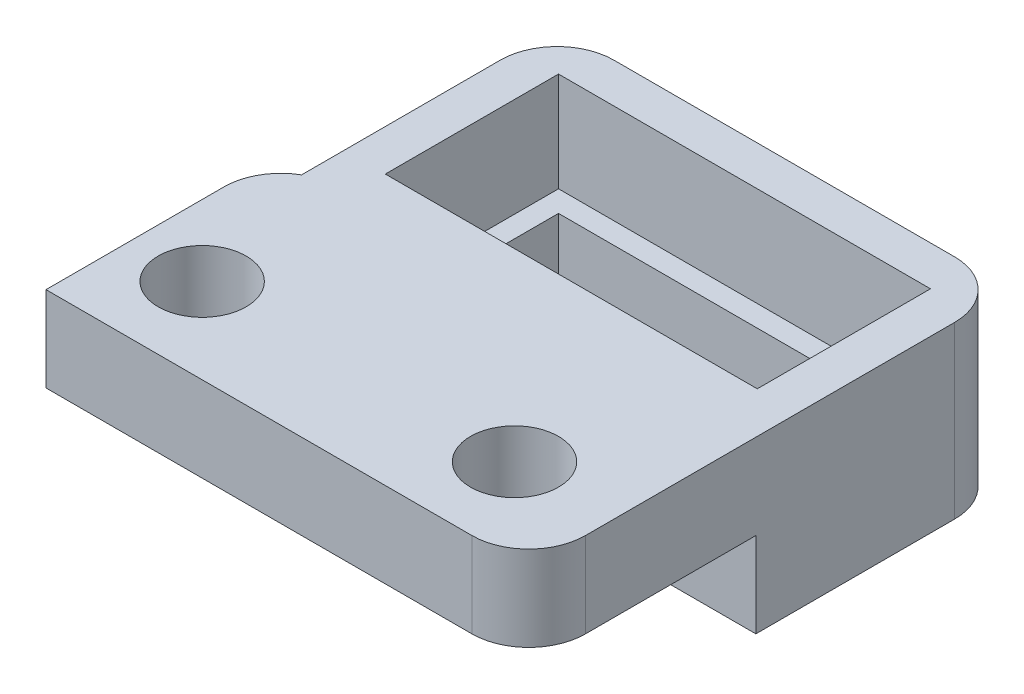
ISO-10303-21;
HEADER;
FILE_DESCRIPTION(('STEP AP214'),'2;1');
FILE_NAME('part.step','',(''),(''),'','','');
FILE_SCHEMA(('AUTOMOTIVE_DESIGN { 1 0 10303 214 1 1 1 1 }'));
ENDSEC;
DATA;
#1=APPLICATION_CONTEXT('core data for automotive mechanical design processes');
#2=APPLICATION_PROTOCOL_DEFINITION('international standard','automotive_design',2000,#1);
#3=PRODUCT_CONTEXT('',#1,'mechanical');
#4=PRODUCT('Part','Part','',(#3));
#5=PRODUCT_RELATED_PRODUCT_CATEGORY('part','',(#4));
#6=PRODUCT_DEFINITION_FORMATION('','',#4);
#7=PRODUCT_DEFINITION_CONTEXT('part definition',#1,'design');
#8=PRODUCT_DEFINITION('design','',#6,#7);
#9=PRODUCT_DEFINITION_SHAPE('','',#8);
#10=(LENGTH_UNIT() NAMED_UNIT(*) SI_UNIT(.MILLI.,.METRE.));
#11=(NAMED_UNIT(*) PLANE_ANGLE_UNIT() SI_UNIT($,.RADIAN.));
#12=(NAMED_UNIT(*) SI_UNIT($,.STERADIAN.) SOLID_ANGLE_UNIT());
#13=UNCERTAINTY_MEASURE_WITH_UNIT(LENGTH_MEASURE(1.E-05),#10,'distance_accuracy_value','');
#14=(GEOMETRIC_REPRESENTATION_CONTEXT(3) GLOBAL_UNCERTAINTY_ASSIGNED_CONTEXT((#13)) GLOBAL_UNIT_ASSIGNED_CONTEXT((#10,
#11,#12)) REPRESENTATION_CONTEXT('',''));
#15=CARTESIAN_POINT('',(0.,0.,0.));
#16=DIRECTION('',(0.,0.,1.));
#17=DIRECTION('',(1.,0.,0.));
#18=AXIS2_PLACEMENT_3D('',#15,#16,#17);
#19=CARTESIAN_POINT('',(0.,3.,0.));
#20=DIRECTION('',(0.,-1.,0.));
#21=DIRECTION('',(0.,0.,-1.));
#22=AXIS2_PLACEMENT_3D('',#19,#20,#21);
#23=PLANE('',#22);
#24=CARTESIAN_POINT('',(3.5,3.,-3.));
#25=DIRECTION('',(0.,1.,0.));
#26=DIRECTION('',(0.,0.,1.));
#27=AXIS2_PLACEMENT_3D('',#24,#25,#26);
#28=CIRCLE('',#27,1.55);
#29=CARTESIAN_POINT('',(3.5,3.,-1.45));
#30=VERTEX_POINT('',#29);
#31=EDGE_CURVE('E213',#30,#30,#28,.T.);
#32=ORIENTED_EDGE('',*,*,#31,.F.);
#33=EDGE_LOOP('',(#32));
#34=FACE_BOUND('',#33,.T.);
#35=CARTESIAN_POINT('',(14.5,3.,-3.));
#36=DIRECTION('',(0.,1.,0.));
#37=DIRECTION('',(0.,0.,1.));
#38=AXIS2_PLACEMENT_3D('',#35,#36,#37);
#39=CIRCLE('',#38,1.55);
#40=CARTESIAN_POINT('',(14.5,3.,-1.45));
#41=VERTEX_POINT('',#40);
#42=EDGE_CURVE('E219',#41,#41,#39,.T.);
#43=ORIENTED_EDGE('',*,*,#42,.F.);
#44=EDGE_LOOP('',(#43));
#45=FACE_BOUND('',#44,.T.);
#46=DIRECTION('',(0.,0.,1.));
#47=VECTOR('',#46,1.);
#48=CARTESIAN_POINT('',(2.,3.,-33.2788205960997));
#49=LINE('',#48,#47);
#50=CARTESIAN_POINT('',(2.,3.,-15.));
#51=VERTEX_POINT('',#50);
#52=CARTESIAN_POINT('',(2.,3.,-8.));
#53=VERTEX_POINT('',#52);
#54=EDGE_CURVE('E158',#51,#53,#49,.T.);
#55=ORIENTED_EDGE('',*,*,#54,.T.);
#56=CARTESIAN_POINT('',(3.,3.,-6.26794919243113));
#57=DIRECTION('',(0.,-1.,0.));
#58=DIRECTION('',(0.,0.,-1.));
#59=AXIS2_PLACEMENT_3D('',#56,#57,#58);
#60=CIRCLE('',#59,2.);
#61=CARTESIAN_POINT('',(1.,3.,-6.26794919243113));
#62=VERTEX_POINT('',#61);
#63=EDGE_CURVE('E11',#53,#62,#60,.F.);
#64=ORIENTED_EDGE('',*,*,#63,.T.);
#65=DIRECTION('',(0.,0.,-1.));
#66=VECTOR('',#65,1.);
#67=CARTESIAN_POINT('',(1.,3.,0.));
#68=LINE('',#67,#66);
#69=CARTESIAN_POINT('',(1.,3.,0.));
#70=VERTEX_POINT('',#69);
#71=EDGE_CURVE('E297',#70,#62,#68,.T.);
#72=ORIENTED_EDGE('',*,*,#71,.F.);
#73=DIRECTION('',(1.,0.,0.));
#74=VECTOR('',#73,1.);
#75=CARTESIAN_POINT('',(0.,3.,0.));
#76=LINE('',#75,#74);
#77=CARTESIAN_POINT('',(16.,3.,0.));
#78=VERTEX_POINT('',#77);
#79=EDGE_CURVE('E210',#70,#78,#76,.T.);
#80=ORIENTED_EDGE('',*,*,#79,.T.);
#81=CARTESIAN_POINT('',(16.,3.,-2.));
#82=DIRECTION('',(0.,-1.,0.));
#83=DIRECTION('',(0.,0.,-1.));
#84=AXIS2_PLACEMENT_3D('',#81,#82,#83);
#85=CIRCLE('',#84,2.);
#86=CARTESIAN_POINT('',(18.,3.,-2.));
#87=VERTEX_POINT('',#86);
#88=EDGE_CURVE('E193',#78,#87,#85,.F.);
#89=ORIENTED_EDGE('',*,*,#88,.T.);
#90=DIRECTION('',(0.,0.,-1.));
#91=VECTOR('',#90,1.);
#92=CARTESIAN_POINT('',(18.,3.,0.));
#93=LINE('',#92,#91);
#94=CARTESIAN_POINT('',(18.,3.,-15.));
#95=VERTEX_POINT('',#94);
#96=EDGE_CURVE('E207',#87,#95,#93,.T.);
#97=ORIENTED_EDGE('',*,*,#96,.T.);
#98=CARTESIAN_POINT('',(16.,3.,-15.));
#99=DIRECTION('',(0.,-1.,0.));
#100=DIRECTION('',(1.,0.,0.));
#101=AXIS2_PLACEMENT_3D('',#98,#99,#100);
#102=CIRCLE('',#101,2.);
#103=CARTESIAN_POINT('',(16.,3.,-17.));
#104=VERTEX_POINT('',#103);
#105=EDGE_CURVE('E313',#95,#104,#102,.F.);
#106=ORIENTED_EDGE('',*,*,#105,.T.);
#107=DIRECTION('',(-1.,0.,0.));
#108=VECTOR('',#107,1.);
#109=CARTESIAN_POINT('',(2.,3.,-17.));
#110=LINE('',#109,#108);
#111=CARTESIAN_POINT('',(4.,3.,-17.));
#112=VERTEX_POINT('',#111);
#113=EDGE_CURVE('E165',#104,#112,#110,.T.);
#114=ORIENTED_EDGE('',*,*,#113,.T.);
#115=CARTESIAN_POINT('',(4.,3.,-15.));
#116=DIRECTION('',(0.,-1.,0.));
#117=DIRECTION('',(1.,0.,0.));
#118=AXIS2_PLACEMENT_3D('',#115,#116,#117);
#119=CIRCLE('',#118,2.);
#120=EDGE_CURVE('E162',#112,#51,#119,.F.);
#121=ORIENTED_EDGE('',*,*,#120,.T.);
#122=EDGE_LOOP('',(#55,#64,#72,#80,#89,#97,#106,#114,#121));
#123=FACE_BOUND('',#122,.T.);
#124=DIRECTION('',(0.,0.,1.));
#125=VECTOR('',#124,1.);
#126=CARTESIAN_POINT('',(3.45,3.,-15.6));
#127=LINE('',#126,#125);
#128=CARTESIAN_POINT('',(3.45,3.,-15.6));
#129=VERTEX_POINT('',#128);
#130=CARTESIAN_POINT('',(3.45,3.,-9.5));
#131=VERTEX_POINT('',#130);
#132=EDGE_CURVE('E310',#129,#131,#127,.T.);
#133=ORIENTED_EDGE('',*,*,#132,.F.);
#134=DIRECTION('',(-1.,0.,0.));
#135=VECTOR('',#134,1.);
#136=CARTESIAN_POINT('',(3.45,3.,-15.6));
#137=LINE('',#136,#135);
#138=CARTESIAN_POINT('',(16.55,3.,-15.6));
#139=VERTEX_POINT('',#138);
#140=EDGE_CURVE('E307',#139,#129,#137,.T.);
#141=ORIENTED_EDGE('',*,*,#140,.F.);
#142=DIRECTION('',(0.,0.,-1.));
#143=VECTOR('',#142,1.);
#144=CARTESIAN_POINT('',(16.55,3.,-15.6));
#145=LINE('',#144,#143);
#146=CARTESIAN_POINT('',(16.55,3.,-9.5));
#147=VERTEX_POINT('',#146);
#148=EDGE_CURVE('E304',#147,#139,#145,.T.);
#149=ORIENTED_EDGE('',*,*,#148,.F.);
#150=DIRECTION('',(1.,0.,0.));
#151=VECTOR('',#150,1.);
#152=CARTESIAN_POINT('',(3.45,3.,-9.5));
#153=LINE('',#152,#151);
#154=EDGE_CURVE('E301',#131,#147,#153,.T.);
#155=ORIENTED_EDGE('',*,*,#154,.F.);
#156=EDGE_LOOP('',(#133,#141,#149,#155));
#157=FACE_BOUND('',#156,.T.);
#158=ADVANCED_FACE('F33',(#34,#45,#123,#157),#23,.F.);
#159=CARTESIAN_POINT('',(0.,0.,0.));
#160=DIRECTION('',(0.,-1.,0.));
#161=DIRECTION('',(0.,0.,-1.));
#162=AXIS2_PLACEMENT_3D('',#159,#160,#161);
#163=PLANE('',#162);
#164=CARTESIAN_POINT('',(3.5,0.,-3.));
#165=DIRECTION('',(0.,1.,0.));
#166=DIRECTION('',(0.,0.,1.));
#167=AXIS2_PLACEMENT_3D('',#164,#165,#166);
#168=CIRCLE('',#167,1.55);
#169=CARTESIAN_POINT('',(3.5,0.,-1.45));
#170=VERTEX_POINT('',#169);
#171=EDGE_CURVE('E216',#170,#170,#168,.T.);
#172=ORIENTED_EDGE('',*,*,#171,.T.);
#173=EDGE_LOOP('',(#172));
#174=FACE_BOUND('',#173,.T.);
#175=CARTESIAN_POINT('',(14.5,0.,-3.));
#176=DIRECTION('',(0.,1.,0.));
#177=DIRECTION('',(0.,0.,1.));
#178=AXIS2_PLACEMENT_3D('',#175,#176,#177);
#179=CIRCLE('',#178,1.55);
#180=CARTESIAN_POINT('',(14.5,0.,-1.45));
#181=VERTEX_POINT('',#180);
#182=EDGE_CURVE('E173',#181,#181,#179,.T.);
#183=ORIENTED_EDGE('',*,*,#182,.T.);
#184=EDGE_LOOP('',(#183));
#185=FACE_BOUND('',#184,.T.);
#186=DIRECTION('',(0.,0.,1.));
#187=VECTOR('',#186,1.);
#188=CARTESIAN_POINT('',(1.,0.,-8.));
#189=LINE('',#188,#187);
#190=CARTESIAN_POINT('',(1.,0.,-6.26794919243113));
#191=VERTEX_POINT('',#190);
#192=CARTESIAN_POINT('',(1.,0.,0.));
#193=VERTEX_POINT('',#192);
#194=EDGE_CURVE('E295',#191,#193,#189,.T.);
#195=ORIENTED_EDGE('',*,*,#194,.F.);
#196=CARTESIAN_POINT('',(3.,0.,-6.26794919243113));
#197=DIRECTION('',(0.,-1.,0.));
#198=DIRECTION('',(0.,0.,-1.));
#199=AXIS2_PLACEMENT_3D('',#196,#197,#198);
#200=CIRCLE('',#199,2.);
#201=CARTESIAN_POINT('',(2.,0.,-8.));
#202=VERTEX_POINT('',#201);
#203=EDGE_CURVE('E41',#191,#202,#200,.T.);
#204=ORIENTED_EDGE('',*,*,#203,.T.);
#205=DIRECTION('',(-1.,0.,0.));
#206=VECTOR('',#205,1.);
#207=CARTESIAN_POINT('',(18.,0.,-8.));
#208=LINE('',#207,#206);
#209=CARTESIAN_POINT('',(18.,0.,-8.));
#210=VERTEX_POINT('',#209);
#211=EDGE_CURVE('E242',#210,#202,#208,.T.);
#212=ORIENTED_EDGE('',*,*,#211,.F.);
#213=DIRECTION('',(0.,0.,-1.));
#214=VECTOR('',#213,1.);
#215=CARTESIAN_POINT('',(18.,0.,0.));
#216=LINE('',#215,#214);
#217=CARTESIAN_POINT('',(18.,0.,-2.));
#218=VERTEX_POINT('',#217);
#219=EDGE_CURVE('E208',#218,#210,#216,.T.);
#220=ORIENTED_EDGE('',*,*,#219,.F.);
#221=CARTESIAN_POINT('',(16.,0.,-2.));
#222=DIRECTION('',(0.,-1.,0.));
#223=DIRECTION('',(0.,0.,-1.));
#224=AXIS2_PLACEMENT_3D('',#221,#222,#223);
#225=CIRCLE('',#224,2.);
#226=CARTESIAN_POINT('',(16.,0.,0.));
#227=VERTEX_POINT('',#226);
#228=EDGE_CURVE('E198',#218,#227,#225,.T.);
#229=ORIENTED_EDGE('',*,*,#228,.T.);
#230=DIRECTION('',(1.,0.,0.));
#231=VECTOR('',#230,1.);
#232=CARTESIAN_POINT('',(0.,0.,0.));
#233=LINE('',#232,#231);
#234=EDGE_CURVE('E211',#193,#227,#233,.T.);
#235=ORIENTED_EDGE('',*,*,#234,.F.);
#236=EDGE_LOOP('',(#195,#204,#212,#220,#229,#235));
#237=FACE_BOUND('',#236,.T.);
#238=ADVANCED_FACE('F344',(#174,#185,#237),#163,.T.);
#239=CARTESIAN_POINT('',(0.,3.,0.));
#240=DIRECTION('',(0.,0.,-1.));
#241=DIRECTION('',(-1.,0.,0.));
#242=AXIS2_PLACEMENT_3D('',#239,#240,#241);
#243=PLANE('',#242);
#244=DIRECTION('',(0.,1.,0.));
#245=VECTOR('',#244,1.);
#246=CARTESIAN_POINT('',(1.,0.,0.));
#247=LINE('',#246,#245);
#248=EDGE_CURVE('E299',#193,#70,#247,.T.);
#249=ORIENTED_EDGE('',*,*,#248,.F.);
#250=ORIENTED_EDGE('',*,*,#234,.T.);
#251=DIRECTION('',(0.,-1.,0.));
#252=VECTOR('',#251,1.);
#253=CARTESIAN_POINT('',(16.,3.,0.));
#254=LINE('',#253,#252);
#255=EDGE_CURVE('E195',#227,#78,#254,.F.);
#256=ORIENTED_EDGE('',*,*,#255,.T.);
#257=ORIENTED_EDGE('',*,*,#79,.F.);
#258=EDGE_LOOP('',(#249,#250,#256,#257));
#259=FACE_BOUND('',#258,.T.);
#260=ADVANCED_FACE('F350',(#259),#243,.F.);
#261=CARTESIAN_POINT('',(3.45,-14.450605523645,-9.5));
#262=DIRECTION('',(0.,0.,1.));
#263=DIRECTION('',(1.,0.,0.));
#264=AXIS2_PLACEMENT_3D('',#261,#262,#263);
#265=PLANE('',#264);
#266=DIRECTION('',(0.,1.,0.));
#267=VECTOR('',#266,1.);
#268=CARTESIAN_POINT('',(3.45,-14.450605523645,-9.5));
#269=LINE('',#268,#267);
#270=CARTESIAN_POINT('',(3.45,-0.5,-9.5));
#271=VERTEX_POINT('',#270);
#272=EDGE_CURVE('E174',#271,#131,#269,.T.);
#273=ORIENTED_EDGE('',*,*,#272,.T.);
#274=ORIENTED_EDGE('',*,*,#154,.T.);
#275=DIRECTION('',(0.,1.,0.));
#276=VECTOR('',#275,1.);
#277=CARTESIAN_POINT('',(16.55,-14.450605523645,-9.5));
#278=LINE('',#277,#276);
#279=CARTESIAN_POINT('',(16.55,-0.5,-9.5));
#280=VERTEX_POINT('',#279);
#281=EDGE_CURVE('E229',#280,#147,#278,.T.);
#282=ORIENTED_EDGE('',*,*,#281,.F.);
#283=DIRECTION('',(-1.,0.,0.));
#284=VECTOR('',#283,1.);
#285=CARTESIAN_POINT('',(16.55,-0.5,-9.5));
#286=LINE('',#285,#284);
#287=EDGE_CURVE('E253',#280,#271,#286,.T.);
#288=ORIENTED_EDGE('',*,*,#287,.T.);
#289=EDGE_LOOP('',(#273,#274,#282,#288));
#290=FACE_BOUND('',#289,.T.);
#291=ADVANCED_FACE('F382',(#290),#265,.F.);
#292=CARTESIAN_POINT('',(16.55,-14.450605523645,-15.6));
#293=DIRECTION('',(1.,0.,0.));
#294=DIRECTION('',(0.,0.,-1.));
#295=AXIS2_PLACEMENT_3D('',#292,#293,#294);
#296=PLANE('',#295);
#297=ORIENTED_EDGE('',*,*,#281,.T.);
#298=ORIENTED_EDGE('',*,*,#148,.T.);
#299=DIRECTION('',(0.,1.,0.));
#300=VECTOR('',#299,1.);
#301=CARTESIAN_POINT('',(16.55,-14.450605523645,-15.6));
#302=LINE('',#301,#300);
#303=CARTESIAN_POINT('',(16.55,-0.5,-15.6));
#304=VERTEX_POINT('',#303);
#305=EDGE_CURVE('E232',#304,#139,#302,.T.);
#306=ORIENTED_EDGE('',*,*,#305,.F.);
#307=DIRECTION('',(0.,0.,1.));
#308=VECTOR('',#307,1.);
#309=CARTESIAN_POINT('',(16.55,-0.5,-15.6));
#310=LINE('',#309,#308);
#311=EDGE_CURVE('E256',#304,#280,#310,.T.);
#312=ORIENTED_EDGE('',*,*,#311,.T.);
#313=EDGE_LOOP('',(#297,#298,#306,#312));
#314=FACE_BOUND('',#313,.T.);
#315=ADVANCED_FACE('F386',(#314),#296,.F.);
#316=CARTESIAN_POINT('',(3.45,-14.450605523645,-15.6));
#317=DIRECTION('',(0.,0.,-1.));
#318=DIRECTION('',(-1.,0.,0.));
#319=AXIS2_PLACEMENT_3D('',#316,#317,#318);
#320=PLANE('',#319);
#321=ORIENTED_EDGE('',*,*,#305,.T.);
#322=ORIENTED_EDGE('',*,*,#140,.T.);
#323=DIRECTION('',(0.,1.,0.));
#324=VECTOR('',#323,1.);
#325=CARTESIAN_POINT('',(3.45,-14.450605523645,-15.6));
#326=LINE('',#325,#324);
#327=CARTESIAN_POINT('',(3.45,-0.5,-15.6));
#328=VERTEX_POINT('',#327);
#329=EDGE_CURVE('E228',#328,#129,#326,.T.);
#330=ORIENTED_EDGE('',*,*,#329,.F.);
#331=DIRECTION('',(1.,0.,0.));
#332=VECTOR('',#331,1.);
#333=CARTESIAN_POINT('',(3.45,-0.5,-15.6));
#334=LINE('',#333,#332);
#335=EDGE_CURVE('E258',#328,#304,#334,.T.);
#336=ORIENTED_EDGE('',*,*,#335,.T.);
#337=EDGE_LOOP('',(#321,#322,#330,#336));
#338=FACE_BOUND('',#337,.T.);
#339=ADVANCED_FACE('F392',(#338),#320,.F.);
#340=CARTESIAN_POINT('',(3.45,-14.450605523645,-15.6));
#341=DIRECTION('',(-1.,0.,0.));
#342=DIRECTION('',(0.,0.,1.));
#343=AXIS2_PLACEMENT_3D('',#340,#341,#342);
#344=PLANE('',#343);
#345=ORIENTED_EDGE('',*,*,#329,.T.);
#346=ORIENTED_EDGE('',*,*,#132,.T.);
#347=ORIENTED_EDGE('',*,*,#272,.F.);
#348=DIRECTION('',(0.,0.,-1.));
#349=VECTOR('',#348,1.);
#350=CARTESIAN_POINT('',(3.45,-0.5,-9.5));
#351=LINE('',#350,#349);
#352=EDGE_CURVE('E246',#271,#328,#351,.T.);
#353=ORIENTED_EDGE('',*,*,#352,.T.);
#354=EDGE_LOOP('',(#345,#346,#347,#353));
#355=FACE_BOUND('',#354,.T.);
#356=ADVANCED_FACE('F380',(#355),#344,.F.);
#357=CARTESIAN_POINT('',(18.,3.,0.));
#358=DIRECTION('',(-1.,0.,0.));
#359=DIRECTION('',(0.,0.,1.));
#360=AXIS2_PLACEMENT_3D('',#357,#358,#359);
#361=PLANE('',#360);
#362=DIRECTION('',(0.,1.,0.));
#363=VECTOR('',#362,1.);
#364=CARTESIAN_POINT('',(18.,3.,-15.));
#365=LINE('',#364,#363);
#366=CARTESIAN_POINT('',(18.,-3.,-15.));
#367=VERTEX_POINT('',#366);
#368=EDGE_CURVE('E204',#367,#95,#365,.T.);
#369=ORIENTED_EDGE('',*,*,#368,.T.);
#370=ORIENTED_EDGE('',*,*,#96,.F.);
#371=DIRECTION('',(0.,-1.,0.));
#372=VECTOR('',#371,1.);
#373=CARTESIAN_POINT('',(18.,3.,-2.));
#374=LINE('',#373,#372);
#375=EDGE_CURVE('E201',#87,#218,#374,.T.);
#376=ORIENTED_EDGE('',*,*,#375,.T.);
#377=ORIENTED_EDGE('',*,*,#219,.T.);
#378=DIRECTION('',(0.,1.,0.));
#379=VECTOR('',#378,1.);
#380=CARTESIAN_POINT('',(18.,-3.,-8.));
#381=LINE('',#380,#379);
#382=CARTESIAN_POINT('',(18.,-3.,-8.));
#383=VERTEX_POINT('',#382);
#384=EDGE_CURVE('E233',#383,#210,#381,.T.);
#385=ORIENTED_EDGE('',*,*,#384,.F.);
#386=DIRECTION('',(0.,0.,1.));
#387=VECTOR('',#386,1.);
#388=CARTESIAN_POINT('',(18.,-3.,-18.));
#389=LINE('',#388,#387);
#390=EDGE_CURVE('E245',#367,#383,#389,.T.);
#391=ORIENTED_EDGE('',*,*,#390,.F.);
#392=EDGE_LOOP('',(#369,#370,#376,#377,#385,#391));
#393=FACE_BOUND('',#392,.T.);
#394=ADVANCED_FACE('F335',(#393),#361,.F.);
#395=CARTESIAN_POINT('',(3.5,3.,-3.));
#396=DIRECTION('',(0.,-1.,0.));
#397=DIRECTION('',(0.,0.,-1.));
#398=AXIS2_PLACEMENT_3D('',#395,#396,#397);
#399=CYLINDRICAL_SURFACE('',#398,1.55);
#400=ORIENTED_EDGE('',*,*,#31,.T.);
#401=EDGE_LOOP('',(#400));
#402=FACE_BOUND('',#401,.T.);
#403=ORIENTED_EDGE('',*,*,#171,.F.);
#404=EDGE_LOOP('',(#403));
#405=FACE_BOUND('',#404,.T.);
#406=ADVANCED_FACE('F376',(#402,#405),#399,.F.);
#407=CARTESIAN_POINT('',(14.5,3.,-3.));
#408=DIRECTION('',(0.,-1.,0.));
#409=DIRECTION('',(0.,0.,-1.));
#410=AXIS2_PLACEMENT_3D('',#407,#408,#409);
#411=CYLINDRICAL_SURFACE('',#410,1.55);
#412=ORIENTED_EDGE('',*,*,#42,.T.);
#413=EDGE_LOOP('',(#412));
#414=FACE_BOUND('',#413,.T.);
#415=ORIENTED_EDGE('',*,*,#182,.F.);
#416=EDGE_LOOP('',(#415));
#417=FACE_BOUND('',#416,.T.);
#418=ADVANCED_FACE('F398',(#414,#417),#411,.F.);
#419=CARTESIAN_POINT('',(2.,16.1980390271856,-18.));
#420=DIRECTION('',(1.,0.,0.));
#421=DIRECTION('',(0.,0.,-1.));
#422=AXIS2_PLACEMENT_3D('',#419,#420,#421);
#423=PLANE('',#422);
#424=DIRECTION('',(0.,-1.,0.));
#425=VECTOR('',#424,1.);
#426=CARTESIAN_POINT('',(2.,16.1980390271856,-8.));
#427=LINE('',#426,#425);
#428=EDGE_CURVE('E168',#53,#202,#427,.T.);
#429=ORIENTED_EDGE('',*,*,#428,.F.);
#430=ORIENTED_EDGE('',*,*,#54,.F.);
#431=DIRECTION('',(0.,1.,0.));
#432=VECTOR('',#431,1.);
#433=CARTESIAN_POINT('',(2.,16.1980390271856,-15.));
#434=LINE('',#433,#432);
#435=CARTESIAN_POINT('',(2.,-3.,-15.));
#436=VERTEX_POINT('',#435);
#437=EDGE_CURVE('E180',#51,#436,#434,.F.);
#438=ORIENTED_EDGE('',*,*,#437,.T.);
#439=DIRECTION('',(0.,0.,-1.));
#440=VECTOR('',#439,1.);
#441=CARTESIAN_POINT('',(2.,-3.,-18.));
#442=LINE('',#441,#440);
#443=CARTESIAN_POINT('',(2.,-3.,-8.));
#444=VERTEX_POINT('',#443);
#445=EDGE_CURVE('E241',#444,#436,#442,.T.);
#446=ORIENTED_EDGE('',*,*,#445,.F.);
#447=DIRECTION('',(0.,1.,0.));
#448=VECTOR('',#447,1.);
#449=CARTESIAN_POINT('',(2.,-3.,-8.));
#450=LINE('',#449,#448);
#451=EDGE_CURVE('E172',#444,#202,#450,.T.);
#452=ORIENTED_EDGE('',*,*,#451,.T.);
#453=EDGE_LOOP('',(#429,#430,#438,#446,#452));
#454=FACE_BOUND('',#453,.T.);
#455=ADVANCED_FACE('F169',(#454),#423,.F.);
#456=CARTESIAN_POINT('',(0.,-3.,0.));
#457=DIRECTION('',(0.,-1.,0.));
#458=DIRECTION('',(0.,0.,-1.));
#459=AXIS2_PLACEMENT_3D('',#456,#457,#458);
#460=PLANE('',#459);
#461=DIRECTION('',(1.,0.,0.));
#462=VECTOR('',#461,1.);
#463=CARTESIAN_POINT('',(2.,-3.,-17.));
#464=LINE('',#463,#462);
#465=CARTESIAN_POINT('',(4.,-3.,-17.));
#466=VERTEX_POINT('',#465);
#467=CARTESIAN_POINT('',(16.,-3.,-17.));
#468=VERTEX_POINT('',#467);
#469=EDGE_CURVE('E282',#466,#468,#464,.T.);
#470=ORIENTED_EDGE('',*,*,#469,.T.);
#471=CARTESIAN_POINT('',(16.,-3.,-15.));
#472=DIRECTION('',(0.,-1.,0.));
#473=DIRECTION('',(0.,0.,-1.));
#474=AXIS2_PLACEMENT_3D('',#471,#472,#473);
#475=CIRCLE('',#474,2.);
#476=EDGE_CURVE('E184',#468,#367,#475,.T.);
#477=ORIENTED_EDGE('',*,*,#476,.T.);
#478=ORIENTED_EDGE('',*,*,#390,.T.);
#479=DIRECTION('',(-1.,0.,0.));
#480=VECTOR('',#479,1.);
#481=CARTESIAN_POINT('',(18.,-3.,-8.));
#482=LINE('',#481,#480);
#483=EDGE_CURVE('E249',#383,#444,#482,.T.);
#484=ORIENTED_EDGE('',*,*,#483,.T.);
#485=ORIENTED_EDGE('',*,*,#445,.T.);
#486=CARTESIAN_POINT('',(4.,-3.,-15.));
#487=DIRECTION('',(0.,-1.,0.));
#488=DIRECTION('',(0.,0.,-1.));
#489=AXIS2_PLACEMENT_3D('',#486,#487,#488);
#490=CIRCLE('',#489,2.);
#491=EDGE_CURVE('E186',#436,#466,#490,.T.);
#492=ORIENTED_EDGE('',*,*,#491,.T.);
#493=EDGE_LOOP('',(#470,#477,#478,#484,#485,#492));
#494=FACE_BOUND('',#493,.T.);
#495=DIRECTION('',(1.,0.,0.));
#496=VECTOR('',#495,1.);
#497=CARTESIAN_POINT('',(4.2,-3.,-14.85));
#498=LINE('',#497,#496);
#499=CARTESIAN_POINT('',(4.2,-3.,-14.85));
#500=VERTEX_POINT('',#499);
#501=CARTESIAN_POINT('',(15.8,-3.,-14.85));
#502=VERTEX_POINT('',#501);
#503=EDGE_CURVE('E280',#500,#502,#498,.T.);
#504=ORIENTED_EDGE('',*,*,#503,.F.);
#505=DIRECTION('',(0.,0.,-1.));
#506=VECTOR('',#505,1.);
#507=CARTESIAN_POINT('',(4.2,-3.,-10.25));
#508=LINE('',#507,#506);
#509=CARTESIAN_POINT('',(4.2,-3.,-10.25));
#510=VERTEX_POINT('',#509);
#511=EDGE_CURVE('E270',#510,#500,#508,.T.);
#512=ORIENTED_EDGE('',*,*,#511,.F.);
#513=DIRECTION('',(-1.,0.,0.));
#514=VECTOR('',#513,1.);
#515=CARTESIAN_POINT('',(15.8,-3.,-10.25));
#516=LINE('',#515,#514);
#517=CARTESIAN_POINT('',(15.8,-3.,-10.25));
#518=VERTEX_POINT('',#517);
#519=EDGE_CURVE('E274',#518,#510,#516,.T.);
#520=ORIENTED_EDGE('',*,*,#519,.F.);
#521=DIRECTION('',(0.,0.,1.));
#522=VECTOR('',#521,1.);
#523=CARTESIAN_POINT('',(15.8,-3.,-14.85));
#524=LINE('',#523,#522);
#525=EDGE_CURVE('E277',#502,#518,#524,.T.);
#526=ORIENTED_EDGE('',*,*,#525,.F.);
#527=EDGE_LOOP('',(#504,#512,#520,#526));
#528=FACE_BOUND('',#527,.T.);
#529=ADVANCED_FACE('F327',(#494,#528),#460,.T.);
#530=CARTESIAN_POINT('',(18.,-3.,-8.));
#531=DIRECTION('',(0.,0.,-1.));
#532=DIRECTION('',(-1.,0.,0.));
#533=AXIS2_PLACEMENT_3D('',#530,#531,#532);
#534=PLANE('',#533);
#535=ORIENTED_EDGE('',*,*,#211,.T.);
#536=ORIENTED_EDGE('',*,*,#451,.F.);
#537=ORIENTED_EDGE('',*,*,#483,.F.);
#538=ORIENTED_EDGE('',*,*,#384,.T.);
#539=EDGE_LOOP('',(#535,#536,#537,#538));
#540=FACE_BOUND('',#539,.T.);
#541=ADVANCED_FACE('F340',(#540),#534,.F.);
#542=CARTESIAN_POINT('',(0.,-0.5,0.));
#543=DIRECTION('',(0.,-1.,0.));
#544=DIRECTION('',(0.,0.,-1.));
#545=AXIS2_PLACEMENT_3D('',#542,#543,#544);
#546=PLANE('',#545);
#547=DIRECTION('',(0.,0.,-1.));
#548=VECTOR('',#547,1.);
#549=CARTESIAN_POINT('',(4.2,-0.5,-10.25));
#550=LINE('',#549,#548);
#551=CARTESIAN_POINT('',(4.2,-0.5,-10.25));
#552=VERTEX_POINT('',#551);
#553=CARTESIAN_POINT('',(4.2,-0.5,-14.85));
#554=VERTEX_POINT('',#553);
#555=EDGE_CURVE('E265',#552,#554,#550,.T.);
#556=ORIENTED_EDGE('',*,*,#555,.T.);
#557=DIRECTION('',(1.,0.,0.));
#558=VECTOR('',#557,1.);
#559=CARTESIAN_POINT('',(4.2,-0.5,-14.85));
#560=LINE('',#559,#558);
#561=CARTESIAN_POINT('',(15.8,-0.5,-14.85));
#562=VERTEX_POINT('',#561);
#563=EDGE_CURVE('E273',#554,#562,#560,.T.);
#564=ORIENTED_EDGE('',*,*,#563,.T.);
#565=DIRECTION('',(0.,0.,1.));
#566=VECTOR('',#565,1.);
#567=CARTESIAN_POINT('',(15.8,-0.5,-14.85));
#568=LINE('',#567,#566);
#569=CARTESIAN_POINT('',(15.8,-0.5,-10.25));
#570=VERTEX_POINT('',#569);
#571=EDGE_CURVE('E288',#562,#570,#568,.T.);
#572=ORIENTED_EDGE('',*,*,#571,.T.);
#573=DIRECTION('',(-1.,0.,0.));
#574=VECTOR('',#573,1.);
#575=CARTESIAN_POINT('',(15.8,-0.5,-10.25));
#576=LINE('',#575,#574);
#577=EDGE_CURVE('E285',#570,#552,#576,.T.);
#578=ORIENTED_EDGE('',*,*,#577,.T.);
#579=EDGE_LOOP('',(#556,#564,#572,#578));
#580=FACE_BOUND('',#579,.T.);
#581=ORIENTED_EDGE('',*,*,#335,.F.);
#582=ORIENTED_EDGE('',*,*,#352,.F.);
#583=ORIENTED_EDGE('',*,*,#287,.F.);
#584=ORIENTED_EDGE('',*,*,#311,.F.);
#585=EDGE_LOOP('',(#581,#582,#583,#584));
#586=FACE_BOUND('',#585,.T.);
#587=ADVANCED_FACE('F503',(#580,#586),#546,.F.);
#588=CARTESIAN_POINT('',(4.2,-0.5,-14.85));
#589=DIRECTION('',(0.,0.,-1.));
#590=DIRECTION('',(-1.,0.,0.));
#591=AXIS2_PLACEMENT_3D('',#588,#589,#590);
#592=PLANE('',#591);
#593=ORIENTED_EDGE('',*,*,#503,.T.);
#594=DIRECTION('',(0.,-1.,0.));
#595=VECTOR('',#594,1.);
#596=CARTESIAN_POINT('',(15.8,-0.5,-14.85));
#597=LINE('',#596,#595);
#598=EDGE_CURVE('E261',#562,#502,#597,.T.);
#599=ORIENTED_EDGE('',*,*,#598,.F.);
#600=ORIENTED_EDGE('',*,*,#563,.F.);
#601=DIRECTION('',(0.,-1.,0.));
#602=VECTOR('',#601,1.);
#603=CARTESIAN_POINT('',(4.2,-0.5,-14.85));
#604=LINE('',#603,#602);
#605=EDGE_CURVE('E260',#554,#500,#604,.T.);
#606=ORIENTED_EDGE('',*,*,#605,.T.);
#607=EDGE_LOOP('',(#593,#599,#600,#606));
#608=FACE_BOUND('',#607,.T.);
#609=ADVANCED_FACE('F493',(#608),#592,.F.);
#610=CARTESIAN_POINT('',(4.2,-0.5,-10.25));
#611=DIRECTION('',(-1.,0.,0.));
#612=DIRECTION('',(0.,0.,1.));
#613=AXIS2_PLACEMENT_3D('',#610,#611,#612);
#614=PLANE('',#613);
#615=ORIENTED_EDGE('',*,*,#511,.T.);
#616=ORIENTED_EDGE('',*,*,#605,.F.);
#617=ORIENTED_EDGE('',*,*,#555,.F.);
#618=DIRECTION('',(0.,-1.,0.));
#619=VECTOR('',#618,1.);
#620=CARTESIAN_POINT('',(4.2,-0.5,-10.25));
#621=LINE('',#620,#619);
#622=EDGE_CURVE('E267',#552,#510,#621,.T.);
#623=ORIENTED_EDGE('',*,*,#622,.T.);
#624=EDGE_LOOP('',(#615,#616,#617,#623));
#625=FACE_BOUND('',#624,.T.);
#626=ADVANCED_FACE('F483',(#625),#614,.F.);
#627=CARTESIAN_POINT('',(15.8,-0.5,-10.25));
#628=DIRECTION('',(0.,0.,1.));
#629=DIRECTION('',(1.,0.,0.));
#630=AXIS2_PLACEMENT_3D('',#627,#628,#629);
#631=PLANE('',#630);
#632=ORIENTED_EDGE('',*,*,#519,.T.);
#633=ORIENTED_EDGE('',*,*,#622,.F.);
#634=ORIENTED_EDGE('',*,*,#577,.F.);
#635=DIRECTION('',(0.,-1.,0.));
#636=VECTOR('',#635,1.);
#637=CARTESIAN_POINT('',(15.8,-0.5,-10.25));
#638=LINE('',#637,#636);
#639=EDGE_CURVE('E264',#570,#518,#638,.T.);
#640=ORIENTED_EDGE('',*,*,#639,.T.);
#641=EDGE_LOOP('',(#632,#633,#634,#640));
#642=FACE_BOUND('',#641,.T.);
#643=ADVANCED_FACE('F473',(#642),#631,.F.);
#644=CARTESIAN_POINT('',(15.8,-0.5,-14.85));
#645=DIRECTION('',(1.,0.,0.));
#646=DIRECTION('',(0.,0.,-1.));
#647=AXIS2_PLACEMENT_3D('',#644,#645,#646);
#648=PLANE('',#647);
#649=ORIENTED_EDGE('',*,*,#525,.T.);
#650=ORIENTED_EDGE('',*,*,#639,.F.);
#651=ORIENTED_EDGE('',*,*,#571,.F.);
#652=ORIENTED_EDGE('',*,*,#598,.T.);
#653=EDGE_LOOP('',(#649,#650,#651,#652));
#654=FACE_BOUND('',#653,.T.);
#655=ADVANCED_FACE('F362',(#654),#648,.F.);
#656=CARTESIAN_POINT('',(2.,-19.0312195418814,-17.));
#657=DIRECTION('',(0.,0.,1.));
#658=DIRECTION('',(1.,0.,0.));
#659=AXIS2_PLACEMENT_3D('',#656,#657,#658);
#660=PLANE('',#659);
#661=DIRECTION('',(0.,1.,0.));
#662=VECTOR('',#661,1.);
#663=CARTESIAN_POINT('',(4.,-19.0312195418814,-17.));
#664=LINE('',#663,#662);
#665=EDGE_CURVE('E190',#466,#112,#664,.T.);
#666=ORIENTED_EDGE('',*,*,#665,.T.);
#667=ORIENTED_EDGE('',*,*,#113,.F.);
#668=DIRECTION('',(0.,1.,0.));
#669=VECTOR('',#668,1.);
#670=CARTESIAN_POINT('',(16.,-19.0312195418814,-17.));
#671=LINE('',#670,#669);
#672=EDGE_CURVE('E188',#104,#468,#671,.F.);
#673=ORIENTED_EDGE('',*,*,#672,.T.);
#674=ORIENTED_EDGE('',*,*,#469,.F.);
#675=EDGE_LOOP('',(#666,#667,#673,#674));
#676=FACE_BOUND('',#675,.T.);
#677=ADVANCED_FACE('F324',(#676),#660,.F.);
#678=CARTESIAN_POINT('',(16.,3.,-2.));
#679=DIRECTION('',(0.,-1.,0.));
#680=DIRECTION('',(0.,0.,-1.));
#681=AXIS2_PLACEMENT_3D('',#678,#679,#680);
#682=CYLINDRICAL_SURFACE('',#681,2.);
#683=ORIENTED_EDGE('',*,*,#88,.F.);
#684=ORIENTED_EDGE('',*,*,#255,.F.);
#685=ORIENTED_EDGE('',*,*,#228,.F.);
#686=ORIENTED_EDGE('',*,*,#375,.F.);
#687=EDGE_LOOP('',(#683,#684,#685,#686));
#688=FACE_BOUND('',#687,.T.);
#689=ADVANCED_FACE('F354',(#688),#682,.T.);
#690=CARTESIAN_POINT('',(16.,3.,-15.));
#691=DIRECTION('',(0.,1.,0.));
#692=DIRECTION('',(0.,0.,1.));
#693=AXIS2_PLACEMENT_3D('',#690,#691,#692);
#694=CYLINDRICAL_SURFACE('',#693,2.);
#695=ORIENTED_EDGE('',*,*,#105,.F.);
#696=ORIENTED_EDGE('',*,*,#368,.F.);
#697=ORIENTED_EDGE('',*,*,#476,.F.);
#698=ORIENTED_EDGE('',*,*,#672,.F.);
#699=EDGE_LOOP('',(#695,#696,#697,#698));
#700=FACE_BOUND('',#699,.T.);
#701=ADVANCED_FACE('F332',(#700),#694,.T.);
#702=CARTESIAN_POINT('',(4.,-19.0312195418814,-15.));
#703=DIRECTION('',(0.,1.,0.));
#704=DIRECTION('',(0.,0.,1.));
#705=AXIS2_PLACEMENT_3D('',#702,#703,#704);
#706=CYLINDRICAL_SURFACE('',#705,2.);
#707=ORIENTED_EDGE('',*,*,#120,.F.);
#708=ORIENTED_EDGE('',*,*,#665,.F.);
#709=ORIENTED_EDGE('',*,*,#491,.F.);
#710=ORIENTED_EDGE('',*,*,#437,.F.);
#711=EDGE_LOOP('',(#707,#708,#709,#710));
#712=FACE_BOUND('',#711,.T.);
#713=ADVANCED_FACE('F321',(#712),#706,.T.);
#714=CARTESIAN_POINT('',(1.,0.,0.));
#715=DIRECTION('',(-1.,0.,0.));
#716=DIRECTION('',(0.,0.,1.));
#717=AXIS2_PLACEMENT_3D('',#714,#715,#716);
#718=PLANE('',#717);
#719=ORIENTED_EDGE('',*,*,#71,.T.);
#720=DIRECTION('',(0.,-1.,0.));
#721=VECTOR('',#720,1.);
#722=CARTESIAN_POINT('',(1.,0.,-6.26794919243113));
#723=LINE('',#722,#721);
#724=EDGE_CURVE('E176',#62,#191,#723,.T.);
#725=ORIENTED_EDGE('',*,*,#724,.T.);
#726=ORIENTED_EDGE('',*,*,#194,.T.);
#727=ORIENTED_EDGE('',*,*,#248,.T.);
#728=EDGE_LOOP('',(#719,#725,#726,#727));
#729=FACE_BOUND('',#728,.T.);
#730=ADVANCED_FACE('F347',(#729),#718,.T.);
#731=CARTESIAN_POINT('',(3.,16.1980390271856,-6.26794919243113));
#732=DIRECTION('',(0.,1.,0.));
#733=DIRECTION('',(0.,0.,1.));
#734=AXIS2_PLACEMENT_3D('',#731,#732,#733);
#735=CYLINDRICAL_SURFACE('',#734,2.);
#736=ORIENTED_EDGE('',*,*,#63,.F.);
#737=ORIENTED_EDGE('',*,*,#428,.T.);
#738=ORIENTED_EDGE('',*,*,#203,.F.);
#739=ORIENTED_EDGE('',*,*,#724,.F.);
#740=EDGE_LOOP('',(#736,#737,#738,#739));
#741=FACE_BOUND('',#740,.T.);
#742=ADVANCED_FACE('F35',(#741),#735,.T.);
#743=CLOSED_SHELL('',(#158,#238,#260,#291,#315,#339,#356,#394,#406,#418,#455,#529,#541,#587,
#609,#626,#643,#655,#677,#689,#701,#713,#730,#742));
#744=MANIFOLD_SOLID_BREP('B2',#743);
#745=ADVANCED_BREP_SHAPE_REPRESENTATION('',(#18,#744),#14);
#746=SHAPE_DEFINITION_REPRESENTATION(#9,#745);
ENDSEC;
END-ISO-10303-21;
